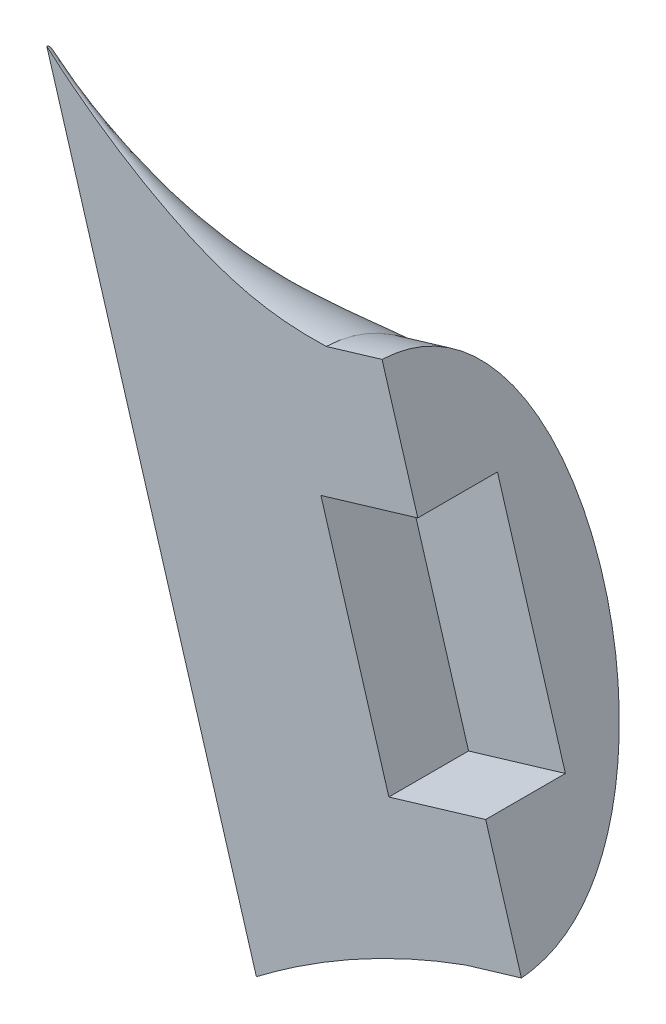
ISO-10303-21;
HEADER;
FILE_DESCRIPTION(('STEP AP214'),'2;1');
FILE_NAME('part.step','',(''),(''),'','','');
FILE_SCHEMA(('AUTOMOTIVE_DESIGN { 1 0 10303 214 1 1 1 1 }'));
ENDSEC;
DATA;
#1=APPLICATION_CONTEXT('core data for automotive mechanical design processes');
#2=APPLICATION_PROTOCOL_DEFINITION('international standard','automotive_design',2000,#1);
#3=PRODUCT_CONTEXT('',#1,'mechanical');
#4=PRODUCT('Part','Part','',(#3));
#5=PRODUCT_RELATED_PRODUCT_CATEGORY('part','',(#4));
#6=PRODUCT_DEFINITION_FORMATION('','',#4);
#7=PRODUCT_DEFINITION_CONTEXT('part definition',#1,'design');
#8=PRODUCT_DEFINITION('design','',#6,#7);
#9=PRODUCT_DEFINITION_SHAPE('','',#8);
#10=(LENGTH_UNIT() NAMED_UNIT(*) SI_UNIT(.MILLI.,.METRE.));
#11=(NAMED_UNIT(*) PLANE_ANGLE_UNIT() SI_UNIT($,.RADIAN.));
#12=(NAMED_UNIT(*) SI_UNIT($,.STERADIAN.) SOLID_ANGLE_UNIT());
#13=UNCERTAINTY_MEASURE_WITH_UNIT(LENGTH_MEASURE(1.E-05),#10,'distance_accuracy_value','');
#14=(GEOMETRIC_REPRESENTATION_CONTEXT(3) GLOBAL_UNCERTAINTY_ASSIGNED_CONTEXT((#13)) GLOBAL_UNIT_ASSIGNED_CONTEXT((#10,
#11,#12)) REPRESENTATION_CONTEXT('',''));
#15=CARTESIAN_POINT('',(0.,0.,0.));
#16=DIRECTION('',(0.,0.,1.));
#17=DIRECTION('',(1.,0.,0.));
#18=AXIS2_PLACEMENT_3D('',#15,#16,#17);
#19=CARTESIAN_POINT('',(68.8351354727939,20.5796630643947,0.));
#20=DIRECTION('',(0.,0.,-1.));
#21=DIRECTION('',(-1.,0.,0.));
#22=AXIS2_PLACEMENT_3D('',#19,#20,#21);
#23=PLANE('',#22);
#24=DIRECTION('',(0.28644268795493,-0.958097378410543,0.));
#25=VECTOR('',#24,1.);
#26=CARTESIAN_POINT('',(75.1754818984992,-8.30803292728945,0.));
#27=LINE('',#26,#25);
#28=CARTESIAN_POINT('',(71.680881105449,3.38075508931917,0.));
#29=VERTEX_POINT('',#28);
#30=CARTESIAN_POINT('',(75.1754818984992,-8.30803292728945,0.));
#31=VERTEX_POINT('',#30);
#32=EDGE_CURVE('E173',#29,#31,#27,.T.);
#33=ORIENTED_EDGE('',*,*,#32,.F.);
#34=DIRECTION('',(0.958097378410543,0.28644268795493,0.));
#35=VECTOR('',#34,1.);
#36=CARTESIAN_POINT('',(71.680881105449,3.38075508931917,0.));
#37=LINE('',#36,#35);
#38=CARTESIAN_POINT('',(76.6629874731838,4.87025706668481,0.));
#39=VERTEX_POINT('',#38);
#40=EDGE_CURVE('E194',#29,#39,#37,.T.);
#41=ORIENTED_EDGE('',*,*,#40,.T.);
#42=DIRECTION('',(-0.28644268795493,0.958097378410543,0.));
#43=VECTOR('',#42,1.);
#44=CARTESIAN_POINT('',(71.7094276080255,21.4389911282595,0.));
#45=LINE('',#44,#43);
#46=CARTESIAN_POINT('',(74.8260320558074,11.0145304018182,-1.99959792391966E-13));
#47=VERTEX_POINT('',#46);
#48=EDGE_CURVE('E128',#39,#47,#45,.T.);
#49=ORIENTED_EDGE('',*,*,#48,.T.);
#50=DIRECTION('',(0.958097378410543,0.28644268795493,0.));
#51=VECTOR('',#50,1.);
#52=CARTESIAN_POINT('',(71.9517399205758,10.1552023379534,-1.98715659294643E-13));
#53=LINE('',#52,#51);
#54=CARTESIAN_POINT('',(71.9517399205758,10.1552023379534,0.));
#55=VERTEX_POINT('',#54);
#56=EDGE_CURVE('E12',#55,#47,#53,.T.);
#57=ORIENTED_EDGE('',*,*,#56,.F.);
#58=CARTESIAN_POINT('',(71.9517399205758,10.1552023379534,0.));
#59=CARTESIAN_POINT('',(69.5938616061763,10.0813238258005,0.));
#60=CARTESIAN_POINT('',(65.4570985045668,10.7673698634453,0.));
#61=CARTESIAN_POINT('',(60.011062756017,14.2052009776582,0.));
#62=CARTESIAN_POINT('',(57.5775416453369,16.3410180657399,0.));
#63=B_SPLINE_CURVE_WITH_KNOTS('',3,(#58,#59,#60,#61,#62),.UNSPECIFIED.,.F.,.F.,(4,1,4),(0.,
0.464218351567374,1.),.UNSPECIFIED.);
#64=CARTESIAN_POINT('',(57.5775416453369,16.3410180657399,0.));
#65=VERTEX_POINT('',#64);
#66=EDGE_CURVE('E191',#65,#55,#63,.F.);
#67=ORIENTED_EDGE('',*,*,#66,.F.);
#68=DIRECTION('',(-0.286442687954896,0.958097378410553,0.));
#69=VECTOR('',#68,1.);
#70=CARTESIAN_POINT('',(68.3594778518222,-19.7225480436874,0.));
#71=LINE('',#70,#69);
#72=CARTESIAN_POINT('',(68.3594778518222,-19.7225480436874,0.));
#73=VERTEX_POINT('',#72);
#74=EDGE_CURVE('E135',#73,#65,#71,.T.);
#75=ORIENTED_EDGE('',*,*,#74,.F.);
#76=CARTESIAN_POINT('',(79.1202515483788,-13.822132348922,0.));
#77=CARTESIAN_POINT('',(77.2430299362491,-14.4970734561594,0.));
#78=CARTESIAN_POINT('',(73.2538280253343,-16.3282447215019,0.));
#79=CARTESIAN_POINT('',(70.0691808052114,-18.4306839193362,0.));
#80=CARTESIAN_POINT('',(68.3594778518222,-19.7225480436874,0.));
#81=B_SPLINE_CURVE_WITH_KNOTS('',3,(#76,#77,#78,#79,#80),.UNSPECIFIED.,.F.,.F.,(4,1,4),(0.,
0.464218351567374,1.),.UNSPECIFIED.);
#82=CARTESIAN_POINT('',(79.1202515483788,-13.822132348922,0.));
#83=VERTEX_POINT('',#82);
#84=EDGE_CURVE('E142',#83,#73,#81,.T.);
#85=ORIENTED_EDGE('',*,*,#84,.F.);
#86=DIRECTION('',(0.958097378410543,0.28644268795493,0.));
#87=VECTOR('',#86,1.);
#88=CARTESIAN_POINT('',(79.1202515483788,-13.822132348922,0.));
#89=LINE('',#88,#87);
#90=CARTESIAN_POINT('',(81.9945436836104,-12.9628042850572,0.));
#91=VERTEX_POINT('',#90);
#92=EDGE_CURVE('E100',#83,#91,#89,.T.);
#93=ORIENTED_EDGE('',*,*,#92,.T.);
#94=CARTESIAN_POINT('',(80.157588266234,-6.81853094992381,0.));
#95=VERTEX_POINT('',#94);
#96=EDGE_CURVE('E184',#91,#95,#45,.T.);
#97=ORIENTED_EDGE('',*,*,#96,.T.);
#98=DIRECTION('',(0.958097378410543,0.28644268795493,0.));
#99=VECTOR('',#98,1.);
#100=CARTESIAN_POINT('',(75.1754818984992,-8.30803292728945,0.));
#101=LINE('',#100,#99);
#102=EDGE_CURVE('E108',#31,#95,#101,.T.);
#103=ORIENTED_EDGE('',*,*,#102,.F.);
#104=EDGE_LOOP('',(#33,#41,#49,#57,#67,#75,#85,#93,#97,#103));
#105=FACE_BOUND('',#104,.T.);
#106=ADVANCED_FACE('F90',(#105),#23,.F.);
#107=CARTESIAN_POINT('',(71.9517399205757,10.1552023379534,0.));
#108=CARTESIAN_POINT('',(72.047540179021,9.83476833727145,-10.4883470019912));
#109=CARTESIAN_POINT('',(78.9396589990728,-13.2180839464793,-10.3872504791322));
#110=CARTESIAN_POINT('',(79.1202515483788,-13.822132348922,0.));
#111=B_SPLINE_CURVE_WITH_KNOTS('',3,(#107,#108,#109,#110),.UNSPECIFIED.,.F.,.F.,(4,4),(0.,1.),.UNSPECIFIED.);
#112=DIRECTION('',(0.958097378410543,0.28644268795493,0.));
#113=VECTOR('',#112,1.);
#114=SURFACE_OF_LINEAR_EXTRUSION('',#111,#113);
#115=CARTESIAN_POINT('',(74.8260320558074,11.0145304018182,0.));
#116=CARTESIAN_POINT('',(74.9218323142527,10.6940964011362,-10.4883470019912));
#117=CARTESIAN_POINT('',(81.8139511343044,-12.3587558826146,-10.3872504791322));
#118=CARTESIAN_POINT('',(81.9945436836104,-12.9628042850572,0.));
#119=B_SPLINE_CURVE_WITH_KNOTS('',3,(#115,#116,#117,#118),.UNSPECIFIED.,.F.,.F.,(4,4),(0.,1.),.UNSPECIFIED.);
#120=EDGE_CURVE('E289',#47,#91,#119,.T.);
#121=ORIENTED_EDGE('',*,*,#120,.T.);
#122=ORIENTED_EDGE('',*,*,#92,.F.);
#123=CARTESIAN_POINT('',(71.9517399205758,10.1552023379534,0.));
#124=CARTESIAN_POINT('',(72.0475401790211,9.83476833727143,-10.4883470019911));
#125=CARTESIAN_POINT('',(78.9396589990728,-13.2180839464794,-10.3872504791321));
#126=CARTESIAN_POINT('',(79.1202515483788,-13.822132348922,0.));
#127=B_SPLINE_CURVE_WITH_KNOTS('',3,(#123,#124,#125,#126),.UNSPECIFIED.,.F.,.F.,(4,4),(0.,1.),.UNSPECIFIED.);
#128=EDGE_CURVE('E203',#55,#83,#127,.T.);
#129=ORIENTED_EDGE('',*,*,#128,.F.);
#130=ORIENTED_EDGE('',*,*,#56,.T.);
#131=EDGE_LOOP('',(#121,#122,#129,#130));
#132=FACE_BOUND('',#131,.T.);
#133=ADVANCED_FACE('F274',(#132),#114,.F.);
#134=CARTESIAN_POINT('',(71.7094276080255,21.4389911282595,0.));
#135=DIRECTION('',(-0.958097378410543,-0.28644268795493,0.));
#136=DIRECTION('',(0.28644268795493,-0.958097378410543,0.));
#137=AXIS2_PLACEMENT_3D('',#134,#135,#136);
#138=PLANE('',#137);
#139=ORIENTED_EDGE('',*,*,#48,.F.);
#140=DIRECTION('',(0.,0.,1.));
#141=VECTOR('',#140,1.);
#142=CARTESIAN_POINT('',(76.6629874731838,4.87025706668481,0.));
#143=LINE('',#142,#141);
#144=CARTESIAN_POINT('',(76.6629874731838,4.87025706668481,-4.10000000000003));
#145=VERTEX_POINT('',#144);
#146=EDGE_CURVE('E180',#145,#39,#143,.T.);
#147=ORIENTED_EDGE('',*,*,#146,.F.);
#148=DIRECTION('',(-0.28644268795493,0.958097378410543,0.));
#149=VECTOR('',#148,1.);
#150=CARTESIAN_POINT('',(76.6629874731838,4.87025706668481,-4.10000000000003));
#151=LINE('',#150,#149);
#152=CARTESIAN_POINT('',(80.157588266234,-6.81853094992381,-4.10000000000003));
#153=VERTEX_POINT('',#152);
#154=EDGE_CURVE('E304',#153,#145,#151,.T.);
#155=ORIENTED_EDGE('',*,*,#154,.F.);
#156=DIRECTION('',(0.,0.,-1.));
#157=VECTOR('',#156,1.);
#158=CARTESIAN_POINT('',(80.157588266234,-6.81853094992381,-4.10000000000003));
#159=LINE('',#158,#157);
#160=EDGE_CURVE('E301',#95,#153,#159,.T.);
#161=ORIENTED_EDGE('',*,*,#160,.F.);
#162=ORIENTED_EDGE('',*,*,#96,.F.);
#163=ORIENTED_EDGE('',*,*,#120,.F.);
#164=EDGE_LOOP('',(#139,#147,#155,#161,#162,#163));
#165=FACE_BOUND('',#164,.T.);
#166=ADVANCED_FACE('F277',(#165),#138,.F.);
#167=CARTESIAN_POINT('',(62.9685097485796,-1.69076498897374,-1.27791279282263));
#168=DIRECTION('',(0.958097378410553,0.286442687954896,0.));
#169=DIRECTION('',(-0.286442687954896,0.958097378410553,0.));
#170=AXIS2_PLACEMENT_3D('',#167,#168,#169);
#171=PLANE('',#170);
#172=CARTESIAN_POINT('',(57.5775416453369,16.3410180657399,0.));
#173=CARTESIAN_POINT('',(57.5775416453369,16.3410180657399,-1.70388372376351));
#174=CARTESIAN_POINT('',(68.3594778518222,-19.7225480436874,-1.70388372376351));
#175=CARTESIAN_POINT('',(68.3594778518222,-19.7225480436874,0.));
#176=B_SPLINE_CURVE_WITH_KNOTS('',3,(#172,#173,#174,#175),.UNSPECIFIED.,.F.,.F.,(4,4),(0.,1.),.UNSPECIFIED.);
#177=EDGE_CURVE('E237',#65,#73,#176,.T.);
#178=ORIENTED_EDGE('',*,*,#177,.T.);
#179=ORIENTED_EDGE('',*,*,#74,.T.);
#180=EDGE_LOOP('',(#178,#179));
#181=FACE_BOUND('',#180,.T.);
#182=ADVANCED_FACE('F222',(#181),#171,.F.);
#183=CARTESIAN_POINT('',(71.9517399205758,10.1552023379534,0.));
#184=CARTESIAN_POINT('',(69.5938616061763,10.0813238258005,0.));
#185=CARTESIAN_POINT('',(65.4570985045668,10.7673698634453,0.));
#186=CARTESIAN_POINT('',(60.011062756017,14.2052009776582,0.));
#187=CARTESIAN_POINT('',(57.5775416453369,16.3410180657399,0.));
#188=CARTESIAN_POINT('',(72.0475401790211,9.83476833727143,-10.4883470019911));
#189=CARTESIAN_POINT('',(69.8498807653782,9.56053562675707,-10.4883470019911));
#190=CARTESIAN_POINT('',(65.4138783339914,10.5729305449382,-6.1919702156649));
#191=CARTESIAN_POINT('',(59.76979003692,15.3477613818025,-1.70388372376351));
#192=CARTESIAN_POINT('',(57.5775416453369,16.3410180657399,-1.70388372376351));
#193=CARTESIAN_POINT('',(78.9396589990728,-13.2180839464794,-10.3872504791321));
#194=CARTESIAN_POINT('',(76.9022184861865,-13.6926708553552,-10.3872504791321));
#195=CARTESIAN_POINT('',(73.3459800759381,-16.2974734173909,-6.25031093128431));
#196=CARTESIAN_POINT('',(70.3104535243084,-19.5732443234805,-1.70388372376351));
#197=CARTESIAN_POINT('',(68.3594778518222,-19.7225480436874,-1.70388372376351));
#198=CARTESIAN_POINT('',(79.1202515483788,-13.822132348922,0.));
#199=CARTESIAN_POINT('',(77.2430299362491,-14.4970734561594,0.));
#200=CARTESIAN_POINT('',(73.2538280253343,-16.3282447215019,0.));
#201=CARTESIAN_POINT('',(70.0691808052114,-18.4306839193362,0.));
#202=CARTESIAN_POINT('',(68.3594778518222,-19.7225480436874,0.));
#203=B_SPLINE_SURFACE_WITH_KNOTS('',3,3,((#183,#184,#185,#186,#187),(#188,#189,#190,#191,#192),
(#193,#194,#195,#196,#197),(#198,#199,#200,#201,#202)),.UNSPECIFIED.,.F.,.F.,.F.,(4,4),(4,1,4),
(0.,1.),(0.,0.464218351567374,1.),.UNSPECIFIED.);
#204=ORIENTED_EDGE('',*,*,#128,.T.);
#205=ORIENTED_EDGE('',*,*,#84,.T.);
#206=ORIENTED_EDGE('',*,*,#177,.F.);
#207=ORIENTED_EDGE('',*,*,#66,.T.);
#208=EDGE_LOOP('',(#204,#205,#206,#207));
#209=FACE_BOUND('',#208,.T.);
#210=ADVANCED_FACE('F209',(#209),#203,.T.);
#211=CARTESIAN_POINT('',(71.680881105449,3.38075508931917,0.));
#212=DIRECTION('',(-0.28644268795493,0.958097378410543,0.));
#213=DIRECTION('',(-0.958097378410543,-0.28644268795493,0.));
#214=AXIS2_PLACEMENT_3D('',#211,#212,#213);
#215=PLANE('',#214);
#216=ORIENTED_EDGE('',*,*,#146,.T.);
#217=ORIENTED_EDGE('',*,*,#40,.F.);
#218=DIRECTION('',(0.,0.,1.));
#219=VECTOR('',#218,1.);
#220=CARTESIAN_POINT('',(71.680881105449,3.38075508931917,0.));
#221=LINE('',#220,#219);
#222=CARTESIAN_POINT('',(71.680881105449,3.38075508931917,-4.10000000000003));
#223=VERTEX_POINT('',#222);
#224=EDGE_CURVE('E179',#223,#29,#221,.T.);
#225=ORIENTED_EDGE('',*,*,#224,.F.);
#226=DIRECTION('',(0.958097378410543,0.28644268795493,0.));
#227=VECTOR('',#226,1.);
#228=CARTESIAN_POINT('',(71.680881105449,3.38075508931917,-4.10000000000003));
#229=LINE('',#228,#227);
#230=EDGE_CURVE('E186',#223,#145,#229,.T.);
#231=ORIENTED_EDGE('',*,*,#230,.T.);
#232=EDGE_LOOP('',(#216,#217,#225,#231));
#233=FACE_BOUND('',#232,.T.);
#234=ADVANCED_FACE('F221',(#233),#215,.F.);
#235=CARTESIAN_POINT('',(71.680881105449,3.38075508931917,-4.10000000000003));
#236=DIRECTION('',(0.,0.,-1.));
#237=DIRECTION('',(-1.,0.,0.));
#238=AXIS2_PLACEMENT_3D('',#235,#236,#237);
#239=PLANE('',#238);
#240=ORIENTED_EDGE('',*,*,#154,.T.);
#241=ORIENTED_EDGE('',*,*,#230,.F.);
#242=DIRECTION('',(-0.28644268795493,0.958097378410543,0.));
#243=VECTOR('',#242,1.);
#244=CARTESIAN_POINT('',(71.680881105449,3.38075508931917,-4.10000000000003));
#245=LINE('',#244,#243);
#246=CARTESIAN_POINT('',(75.1754818984992,-8.30803292728945,-4.10000000000003));
#247=VERTEX_POINT('',#246);
#248=EDGE_CURVE('E172',#247,#223,#245,.T.);
#249=ORIENTED_EDGE('',*,*,#248,.F.);
#250=DIRECTION('',(0.958097378410543,0.28644268795493,0.));
#251=VECTOR('',#250,1.);
#252=CARTESIAN_POINT('',(75.1754818984992,-8.30803292728945,-4.10000000000003));
#253=LINE('',#252,#251);
#254=EDGE_CURVE('E168',#247,#153,#253,.T.);
#255=ORIENTED_EDGE('',*,*,#254,.T.);
#256=EDGE_LOOP('',(#240,#241,#249,#255));
#257=FACE_BOUND('',#256,.T.);
#258=ADVANCED_FACE('F312',(#257),#239,.F.);
#259=CARTESIAN_POINT('',(75.1754818984992,-8.30803292728945,-4.10000000000003));
#260=DIRECTION('',(0.28644268795493,-0.958097378410543,0.));
#261=DIRECTION('',(0.958097378410543,0.28644268795493,0.));
#262=AXIS2_PLACEMENT_3D('',#259,#260,#261);
#263=PLANE('',#262);
#264=ORIENTED_EDGE('',*,*,#160,.T.);
#265=ORIENTED_EDGE('',*,*,#254,.F.);
#266=DIRECTION('',(0.,0.,-1.));
#267=VECTOR('',#266,1.);
#268=CARTESIAN_POINT('',(75.1754818984992,-8.30803292728945,-4.10000000000003));
#269=LINE('',#268,#267);
#270=EDGE_CURVE('E165',#31,#247,#269,.T.);
#271=ORIENTED_EDGE('',*,*,#270,.F.);
#272=ORIENTED_EDGE('',*,*,#102,.T.);
#273=EDGE_LOOP('',(#264,#265,#271,#272));
#274=FACE_BOUND('',#273,.T.);
#275=ADVANCED_FACE('F167',(#274),#263,.F.);
#276=CARTESIAN_POINT('',(66.7273212402907,19.9494891508938,0.));
#277=DIRECTION('',(-0.958097378410543,-0.28644268795493,0.));
#278=DIRECTION('',(0.28644268795493,-0.958097378410543,0.));
#279=AXIS2_PLACEMENT_3D('',#276,#277,#278);
#280=PLANE('',#279);
#281=ORIENTED_EDGE('',*,*,#32,.T.);
#282=ORIENTED_EDGE('',*,*,#270,.T.);
#283=ORIENTED_EDGE('',*,*,#248,.T.);
#284=ORIENTED_EDGE('',*,*,#224,.T.);
#285=EDGE_LOOP('',(#281,#282,#283,#284));
#286=FACE_BOUND('',#285,.T.);
#287=ADVANCED_FACE('F177',(#286),#280,.F.);
#288=CLOSED_SHELL('',(#106,#133,#166,#182,#210,#234,#258,#275,#287));
#289=MANIFOLD_SOLID_BREP('B2',#288);
#290=ADVANCED_BREP_SHAPE_REPRESENTATION('',(#18,#289),#14);
#291=SHAPE_DEFINITION_REPRESENTATION(#9,#290);
ENDSEC;
END-ISO-10303-21;
